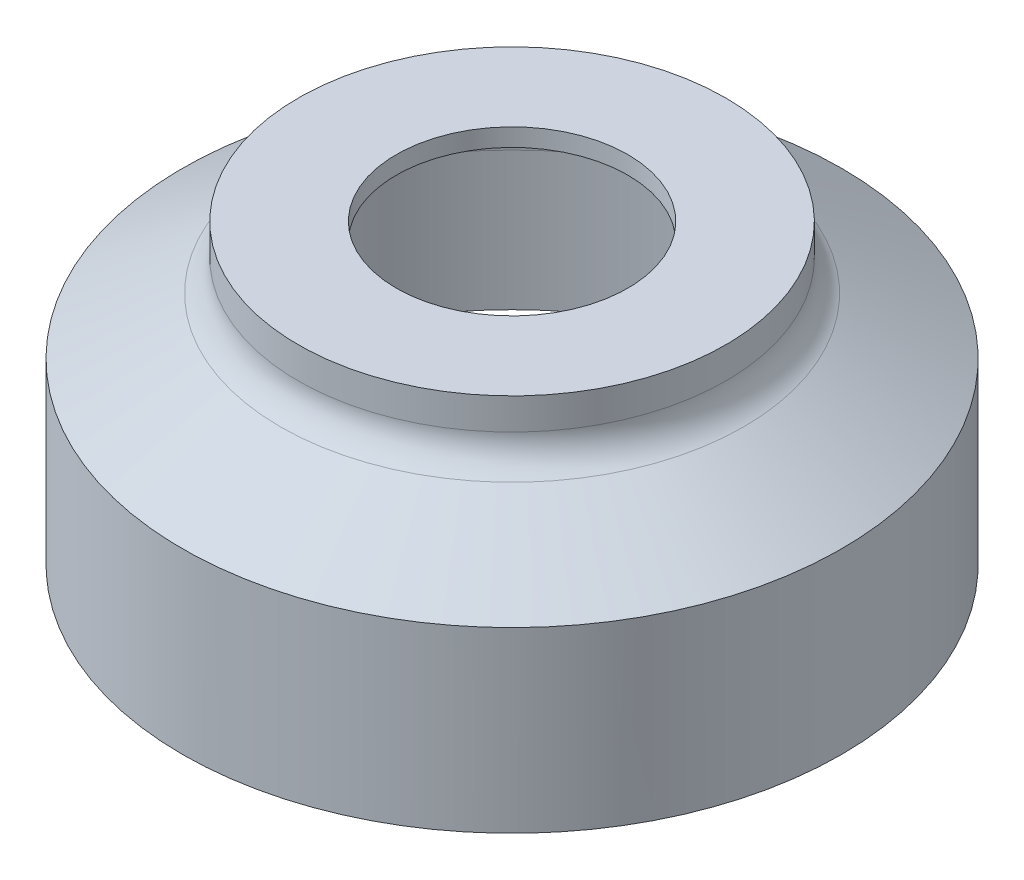
ISO-10303-21;
HEADER;
FILE_DESCRIPTION(('STEP AP214'),'2;1');
FILE_NAME('part.step','',(''),(''),'','','');
FILE_SCHEMA(('AUTOMOTIVE_DESIGN { 1 0 10303 214 1 1 1 1 }'));
ENDSEC;
DATA;
#1=APPLICATION_CONTEXT('core data for automotive mechanical design processes');
#2=APPLICATION_PROTOCOL_DEFINITION('international standard','automotive_design',2000,#1);
#3=PRODUCT_CONTEXT('',#1,'mechanical');
#4=PRODUCT('Part','Part','',(#3));
#5=PRODUCT_RELATED_PRODUCT_CATEGORY('part','',(#4));
#6=PRODUCT_DEFINITION_FORMATION('','',#4);
#7=PRODUCT_DEFINITION_CONTEXT('part definition',#1,'design');
#8=PRODUCT_DEFINITION('design','',#6,#7);
#9=PRODUCT_DEFINITION_SHAPE('','',#8);
#10=(LENGTH_UNIT() NAMED_UNIT(*) SI_UNIT(.MILLI.,.METRE.));
#11=(NAMED_UNIT(*) PLANE_ANGLE_UNIT() SI_UNIT($,.RADIAN.));
#12=(NAMED_UNIT(*) SI_UNIT($,.STERADIAN.) SOLID_ANGLE_UNIT());
#13=UNCERTAINTY_MEASURE_WITH_UNIT(LENGTH_MEASURE(1.E-05),#10,'distance_accuracy_value','');
#14=(GEOMETRIC_REPRESENTATION_CONTEXT(3) GLOBAL_UNCERTAINTY_ASSIGNED_CONTEXT((#13)) GLOBAL_UNIT_ASSIGNED_CONTEXT((#10,
#11,#12)) REPRESENTATION_CONTEXT('',''));
#15=CARTESIAN_POINT('',(0.,0.,0.));
#16=DIRECTION('',(0.,0.,1.));
#17=DIRECTION('',(1.,0.,0.));
#18=AXIS2_PLACEMENT_3D('',#15,#16,#17);
#19=CARTESIAN_POINT('',(0.,12.7,0.));
#20=DIRECTION('',(0.,-1.,0.));
#21=DIRECTION('',(0.,0.,-1.));
#22=AXIS2_PLACEMENT_3D('',#19,#20,#21);
#23=CYLINDRICAL_SURFACE('',#22,14.097);
#24=CARTESIAN_POINT('',(0.,7.62,0.));
#25=DIRECTION('',(0.,-1.,0.));
#26=DIRECTION('',(0.,0.,-1.));
#27=AXIS2_PLACEMENT_3D('',#24,#25,#26);
#28=CIRCLE('',#27,14.097);
#29=CARTESIAN_POINT('',(0.,7.62,-14.097));
#30=VERTEX_POINT('',#29);
#31=EDGE_CURVE('E72',#30,#30,#28,.T.);
#32=ORIENTED_EDGE('',*,*,#31,.T.);
#33=EDGE_LOOP('',(#32));
#34=FACE_BOUND('',#33,.T.);
#35=CARTESIAN_POINT('',(0.,0.,0.));
#36=DIRECTION('',(0.,1.,0.));
#37=DIRECTION('',(0.,0.,1.));
#38=AXIS2_PLACEMENT_3D('',#35,#36,#37);
#39=CIRCLE('',#38,14.097);
#40=CARTESIAN_POINT('',(0.,0.,14.097));
#41=VERTEX_POINT('',#40);
#42=EDGE_CURVE('E10',#41,#41,#39,.T.);
#43=ORIENTED_EDGE('',*,*,#42,.T.);
#44=EDGE_LOOP('',(#43));
#45=FACE_BOUND('',#44,.T.);
#46=ADVANCED_FACE('F32',(#34,#45),#23,.T.);
#47=CARTESIAN_POINT('',(0.,12.7,0.));
#48=DIRECTION('',(0.,1.,0.));
#49=DIRECTION('',(0.,0.,1.));
#50=AXIS2_PLACEMENT_3D('',#47,#48,#49);
#51=PLANE('',#50);
#52=CARTESIAN_POINT('',(0.,12.7,0.));
#53=DIRECTION('',(0.,-1.,0.));
#54=DIRECTION('',(0.,0.,-1.));
#55=AXIS2_PLACEMENT_3D('',#52,#53,#54);
#56=CIRCLE('',#55,9.144);
#57=CARTESIAN_POINT('',(0.,12.7,-9.144));
#58=VERTEX_POINT('',#57);
#59=EDGE_CURVE('E63',#58,#58,#56,.T.);
#60=ORIENTED_EDGE('',*,*,#59,.F.);
#61=EDGE_LOOP('',(#60));
#62=FACE_BOUND('',#61,.T.);
#63=CARTESIAN_POINT('',(0.,12.7,0.));
#64=DIRECTION('',(0.,-1.,0.));
#65=DIRECTION('',(0.,0.,-1.));
#66=AXIS2_PLACEMENT_3D('',#63,#64,#65);
#67=CIRCLE('',#66,4.953);
#68=CARTESIAN_POINT('',(0.,12.7,-4.953));
#69=VERTEX_POINT('',#68);
#70=EDGE_CURVE('E38',#69,#69,#67,.T.);
#71=ORIENTED_EDGE('',*,*,#70,.T.);
#72=EDGE_LOOP('',(#71));
#73=FACE_BOUND('',#72,.T.);
#74=ADVANCED_FACE('F96',(#62,#73),#51,.T.);
#75=CARTESIAN_POINT('',(0.,0.,0.));
#76=DIRECTION('',(0.,1.,0.));
#77=DIRECTION('',(0.,0.,1.));
#78=AXIS2_PLACEMENT_3D('',#75,#76,#77);
#79=PLANE('',#78);
#80=CARTESIAN_POINT('',(0.,0.,0.));
#81=DIRECTION('',(0.,-1.,0.));
#82=DIRECTION('',(0.,0.,-1.));
#83=AXIS2_PLACEMENT_3D('',#80,#81,#82);
#84=CIRCLE('',#83,13.335);
#85=CARTESIAN_POINT('',(0.,0.,-13.335));
#86=VERTEX_POINT('',#85);
#87=EDGE_CURVE('E60',#86,#86,#84,.T.);
#88=ORIENTED_EDGE('',*,*,#87,.F.);
#89=EDGE_LOOP('',(#88));
#90=FACE_BOUND('',#89,.T.);
#91=ORIENTED_EDGE('',*,*,#42,.F.);
#92=EDGE_LOOP('',(#91));
#93=FACE_BOUND('',#92,.T.);
#94=ADVANCED_FACE('F98',(#90,#93),#79,.F.);
#95=CARTESIAN_POINT('',(0.,0.,0.));
#96=DIRECTION('',(0.,-1.,0.));
#97=DIRECTION('',(0.,0.,-1.));
#98=AXIS2_PLACEMENT_3D('',#95,#96,#97);
#99=CYLINDRICAL_SURFACE('',#98,4.953);
#100=ORIENTED_EDGE('',*,*,#70,.F.);
#101=EDGE_LOOP('',(#100));
#102=FACE_BOUND('',#101,.T.);
#103=CARTESIAN_POINT('',(0.,11.938,0.));
#104=DIRECTION('',(0.,-1.,0.));
#105=DIRECTION('',(0.,0.,-1.));
#106=AXIS2_PLACEMENT_3D('',#103,#104,#105);
#107=CIRCLE('',#106,4.953);
#108=CARTESIAN_POINT('',(0.,11.938,-4.953));
#109=VERTEX_POINT('',#108);
#110=EDGE_CURVE('E42',#109,#109,#107,.T.);
#111=ORIENTED_EDGE('',*,*,#110,.T.);
#112=EDGE_LOOP('',(#111));
#113=FACE_BOUND('',#112,.T.);
#114=ADVANCED_FACE('F104',(#102,#113),#99,.F.);
#115=CARTESIAN_POINT('',(4.953,11.938,0.));
#116=DIRECTION('',(0.,1.,0.));
#117=DIRECTION('',(0.,0.,1.));
#118=AXIS2_PLACEMENT_3D('',#115,#116,#117);
#119=PLANE('',#118);
#120=ORIENTED_EDGE('',*,*,#110,.F.);
#121=EDGE_LOOP('',(#120));
#122=FACE_BOUND('',#121,.T.);
#123=CARTESIAN_POINT('',(0.,11.938,0.));
#124=DIRECTION('',(0.,-1.,0.));
#125=DIRECTION('',(0.,0.,-1.));
#126=AXIS2_PLACEMENT_3D('',#123,#124,#125);
#127=CIRCLE('',#126,8.382);
#128=CARTESIAN_POINT('',(0.,11.938,-8.382));
#129=VERTEX_POINT('',#128);
#130=EDGE_CURVE('E46',#129,#129,#127,.T.);
#131=ORIENTED_EDGE('',*,*,#130,.T.);
#132=EDGE_LOOP('',(#131));
#133=FACE_BOUND('',#132,.T.);
#134=ADVANCED_FACE('F109',(#122,#133),#119,.F.);
#135=CARTESIAN_POINT('',(0.,0.,0.));
#136=DIRECTION('',(0.,-1.,0.));
#137=DIRECTION('',(0.,0.,-1.));
#138=AXIS2_PLACEMENT_3D('',#135,#136,#137);
#139=CYLINDRICAL_SURFACE('',#138,8.382);
#140=ORIENTED_EDGE('',*,*,#130,.F.);
#141=EDGE_LOOP('',(#140));
#142=FACE_BOUND('',#141,.T.);
#143=CARTESIAN_POINT('',(0.,9.652,0.));
#144=DIRECTION('',(0.,-1.,0.));
#145=DIRECTION('',(0.,0.,-1.));
#146=AXIS2_PLACEMENT_3D('',#143,#144,#145);
#147=CIRCLE('',#146,8.382);
#148=CARTESIAN_POINT('',(0.,9.652,-8.382));
#149=VERTEX_POINT('',#148);
#150=EDGE_CURVE('E51',#149,#149,#147,.T.);
#151=ORIENTED_EDGE('',*,*,#150,.T.);
#152=EDGE_LOOP('',(#151));
#153=FACE_BOUND('',#152,.T.);
#154=ADVANCED_FACE('F113',(#142,#153),#139,.F.);
#155=CARTESIAN_POINT('',(0.,7.2323250218263,0.));
#156=DIRECTION('',(0.,-1.,0.));
#157=DIRECTION('',(0.,0.,-1.));
#158=AXIS2_PLACEMENT_3D('',#155,#156,#157);
#159=CONICAL_SURFACE('',#158,12.573,1.0471975511966);
#160=ORIENTED_EDGE('',*,*,#150,.F.);
#161=EDGE_LOOP('',(#160));
#162=FACE_BOUND('',#161,.T.);
#163=CARTESIAN_POINT('',(0.,7.2323250218263,0.));
#164=DIRECTION('',(0.,-1.,0.));
#165=DIRECTION('',(0.,0.,-1.));
#166=AXIS2_PLACEMENT_3D('',#163,#164,#165);
#167=CIRCLE('',#166,12.573);
#168=CARTESIAN_POINT('',(0.,7.2323250218263,-12.573));
#169=VERTEX_POINT('',#168);
#170=EDGE_CURVE('E54',#169,#169,#167,.T.);
#171=ORIENTED_EDGE('',*,*,#170,.T.);
#172=EDGE_LOOP('',(#171));
#173=FACE_BOUND('',#172,.T.);
#174=ADVANCED_FACE('F117',(#162,#173),#159,.F.);
#175=CARTESIAN_POINT('',(0.,5.91250230645881,0.));
#176=DIRECTION('',(0.,-1.,0.));
#177=DIRECTION('',(0.,0.,-1.));
#178=AXIS2_PLACEMENT_3D('',#175,#176,#177);
#179=TOROIDAL_SURFACE('',#178,11.811,1.524);
#180=ORIENTED_EDGE('',*,*,#170,.F.);
#181=EDGE_LOOP('',(#180));
#182=FACE_BOUND('',#181,.T.);
#183=CARTESIAN_POINT('',(0.,5.91250230645881,0.));
#184=DIRECTION('',(0.,-1.,0.));
#185=DIRECTION('',(0.,0.,-1.));
#186=AXIS2_PLACEMENT_3D('',#183,#184,#185);
#187=CIRCLE('',#186,13.335);
#188=CARTESIAN_POINT('',(0.,5.91250230645881,-13.335));
#189=VERTEX_POINT('',#188);
#190=EDGE_CURVE('E57',#189,#189,#187,.T.);
#191=ORIENTED_EDGE('',*,*,#190,.T.);
#192=EDGE_LOOP('',(#191));
#193=FACE_BOUND('',#192,.T.);
#194=ADVANCED_FACE('F121',(#182,#193),#179,.F.);
#195=CARTESIAN_POINT('',(0.,0.,0.));
#196=DIRECTION('',(0.,-1.,0.));
#197=DIRECTION('',(0.,0.,-1.));
#198=AXIS2_PLACEMENT_3D('',#195,#196,#197);
#199=CYLINDRICAL_SURFACE('',#198,13.335);
#200=ORIENTED_EDGE('',*,*,#190,.F.);
#201=EDGE_LOOP('',(#200));
#202=FACE_BOUND('',#201,.T.);
#203=ORIENTED_EDGE('',*,*,#87,.T.);
#204=EDGE_LOOP('',(#203));
#205=FACE_BOUND('',#204,.T.);
#206=ADVANCED_FACE('F92',(#202,#205),#199,.F.);
#207=CARTESIAN_POINT('',(0.,0.,0.));
#208=DIRECTION('',(0.,-1.,0.));
#209=DIRECTION('',(0.,0.,-1.));
#210=AXIS2_PLACEMENT_3D('',#207,#208,#209);
#211=CYLINDRICAL_SURFACE('',#210,9.144);
#212=CARTESIAN_POINT('',(0.,11.3594976935412,0.));
#213=DIRECTION('',(0.,-1.,0.));
#214=DIRECTION('',(0.,0.,-1.));
#215=AXIS2_PLACEMENT_3D('',#212,#213,#214);
#216=CIRCLE('',#215,9.144);
#217=CARTESIAN_POINT('',(0.,11.3594976935412,-9.144));
#218=VERTEX_POINT('',#217);
#219=EDGE_CURVE('E66',#218,#218,#216,.T.);
#220=ORIENTED_EDGE('',*,*,#219,.F.);
#221=EDGE_LOOP('',(#220));
#222=FACE_BOUND('',#221,.T.);
#223=ORIENTED_EDGE('',*,*,#59,.T.);
#224=EDGE_LOOP('',(#223));
#225=FACE_BOUND('',#224,.T.);
#226=ADVANCED_FACE('F86',(#222,#225),#211,.T.);
#227=CARTESIAN_POINT('',(0.,11.3594976935412,0.));
#228=DIRECTION('',(0.,-1.,0.));
#229=DIRECTION('',(0.,0.,-1.));
#230=AXIS2_PLACEMENT_3D('',#227,#228,#229);
#231=TOROIDAL_SURFACE('',#230,10.668,1.524);
#232=CARTESIAN_POINT('',(0.,10.0396749781738,0.));
#233=DIRECTION('',(0.,-1.,0.));
#234=DIRECTION('',(0.,0.,-1.));
#235=AXIS2_PLACEMENT_3D('',#232,#233,#234);
#236=CIRCLE('',#235,9.906);
#237=CARTESIAN_POINT('',(0.,10.0396749781738,-9.906));
#238=VERTEX_POINT('',#237);
#239=EDGE_CURVE('E69',#238,#238,#236,.T.);
#240=ORIENTED_EDGE('',*,*,#239,.F.);
#241=EDGE_LOOP('',(#240));
#242=FACE_BOUND('',#241,.T.);
#243=ORIENTED_EDGE('',*,*,#219,.T.);
#244=EDGE_LOOP('',(#243));
#245=FACE_BOUND('',#244,.T.);
#246=ADVANCED_FACE('F80',(#242,#245),#231,.F.);
#247=CARTESIAN_POINT('',(0.,10.0396749781738,0.));
#248=DIRECTION('',(0.,-1.,0.));
#249=DIRECTION('',(0.,0.,-1.));
#250=AXIS2_PLACEMENT_3D('',#247,#248,#249);
#251=CONICAL_SURFACE('',#250,9.906,1.04719755119659);
#252=ORIENTED_EDGE('',*,*,#31,.F.);
#253=EDGE_LOOP('',(#252));
#254=FACE_BOUND('',#253,.T.);
#255=ORIENTED_EDGE('',*,*,#239,.T.);
#256=EDGE_LOOP('',(#255));
#257=FACE_BOUND('',#256,.T.);
#258=ADVANCED_FACE('F77',(#254,#257),#251,.T.);
#259=CLOSED_SHELL('',(#46,#74,#94,#114,#134,#154,#174,#194,#206,#226,#246,#258));
#260=MANIFOLD_SOLID_BREP('B2',#259);
#261=ADVANCED_BREP_SHAPE_REPRESENTATION('',(#18,#260),#14);
#262=SHAPE_DEFINITION_REPRESENTATION(#9,#261);
ENDSEC;
END-ISO-10303-21;
